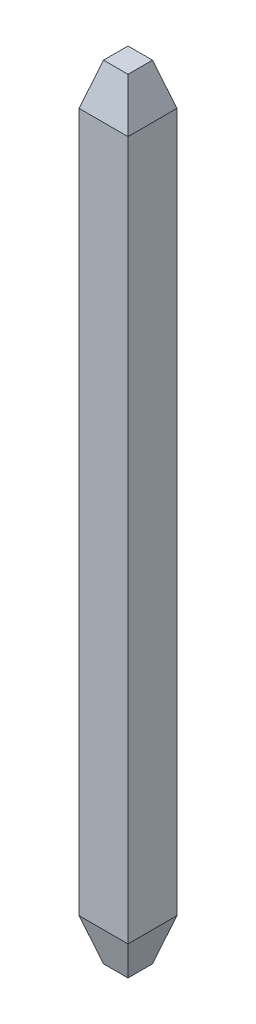
ISO-10303-21;
HEADER;
FILE_DESCRIPTION(('STEP AP214'),'2;1');
FILE_NAME('part.step','',(''),(''),'','','');
FILE_SCHEMA(('AUTOMOTIVE_DESIGN { 1 0 10303 214 1 1 1 1 }'));
ENDSEC;
DATA;
#1=APPLICATION_CONTEXT('core data for automotive mechanical design processes');
#2=APPLICATION_PROTOCOL_DEFINITION('international standard','automotive_design',2000,#1);
#3=PRODUCT_CONTEXT('',#1,'mechanical');
#4=PRODUCT('Part','Part','',(#3));
#5=PRODUCT_RELATED_PRODUCT_CATEGORY('part','',(#4));
#6=PRODUCT_DEFINITION_FORMATION('','',#4);
#7=PRODUCT_DEFINITION_CONTEXT('part definition',#1,'design');
#8=PRODUCT_DEFINITION('design','',#6,#7);
#9=PRODUCT_DEFINITION_SHAPE('','',#8);
#10=(LENGTH_UNIT() NAMED_UNIT(*) SI_UNIT(.MILLI.,.METRE.));
#11=(NAMED_UNIT(*) PLANE_ANGLE_UNIT() SI_UNIT($,.RADIAN.));
#12=(NAMED_UNIT(*) SI_UNIT($,.STERADIAN.) SOLID_ANGLE_UNIT());
#13=UNCERTAINTY_MEASURE_WITH_UNIT(LENGTH_MEASURE(1.E-05),#10,'distance_accuracy_value','');
#14=(GEOMETRIC_REPRESENTATION_CONTEXT(3) GLOBAL_UNCERTAINTY_ASSIGNED_CONTEXT((#13)) GLOBAL_UNIT_ASSIGNED_CONTEXT((#10,
#11,#12)) REPRESENTATION_CONTEXT('',''));
#15=CARTESIAN_POINT('',(0.,0.,0.));
#16=DIRECTION('',(0.,0.,1.));
#17=DIRECTION('',(1.,0.,0.));
#18=AXIS2_PLACEMENT_3D('',#15,#16,#17);
#19=CARTESIAN_POINT('',(-24.289999999987,-5.53543505344796,-19.1989999999763));
#20=DIRECTION('',(-1.,0.,0.));
#21=DIRECTION('',(0.,0.,1.));
#22=AXIS2_PLACEMENT_3D('',#19,#20,#21);
#23=PLANE('',#22);
#24=DIRECTION('',(0.,1.,0.));
#25=VECTOR('',#24,1.);
#26=CARTESIAN_POINT('',(-24.289999999987,-10.1039999999832,-19.8399999999763));
#27=LINE('',#26,#25);
#28=CARTESIAN_POINT('',(-24.289999999987,-10.1039999999832,-19.8399999999763));
#29=VERTEX_POINT('',#28);
#30=CARTESIAN_POINT('',(-24.289999999987,-0.965870106912723,-19.8399999999763));
#31=VERTEX_POINT('',#30);
#32=EDGE_CURVE('E20',#29,#31,#27,.T.);
#33=ORIENTED_EDGE('',*,*,#32,.F.);
#34=DIRECTION('',(0.,0.,-1.));
#35=VECTOR('',#34,1.);
#36=CARTESIAN_POINT('',(-24.289999999987,-10.1039999999832,-19.1999999999763));
#37=LINE('',#36,#35);
#38=CARTESIAN_POINT('',(-24.289999999987,-10.1039999999832,-19.1999999999763));
#39=VERTEX_POINT('',#38);
#40=EDGE_CURVE('E41',#39,#29,#37,.T.);
#41=ORIENTED_EDGE('',*,*,#40,.F.);
#42=DIRECTION('',(0.,1.,0.));
#43=VECTOR('',#42,1.);
#44=CARTESIAN_POINT('',(-24.289999999987,-10.1039999999832,-19.1999999999763));
#45=LINE('',#44,#43);
#46=CARTESIAN_POINT('',(-24.289999999987,-0.965870106912723,-19.1999999999763));
#47=VERTEX_POINT('',#46);
#48=EDGE_CURVE('E11',#39,#47,#45,.T.);
#49=ORIENTED_EDGE('',*,*,#48,.T.);
#50=DIRECTION('',(0.,0.,-1.));
#51=VECTOR('',#50,1.);
#52=CARTESIAN_POINT('',(-24.289999999987,-0.965870106912721,-19.1999999999763));
#53=LINE('',#52,#51);
#54=EDGE_CURVE('E27',#47,#31,#53,.T.);
#55=ORIENTED_EDGE('',*,*,#54,.T.);
#56=EDGE_LOOP('',(#33,#41,#49,#55));
#57=FACE_BOUND('',#56,.T.);
#58=ADVANCED_FACE('F17',(#57),#23,.T.);
#59=CARTESIAN_POINT('',(-23.648999999987,-5.53443505344796,-19.8399999999763));
#60=DIRECTION('',(0.,0.,-1.));
#61=DIRECTION('',(0.,-1.,0.));
#62=AXIS2_PLACEMENT_3D('',#59,#60,#61);
#63=PLANE('',#62);
#64=DIRECTION('',(0.,1.,0.));
#65=VECTOR('',#64,1.);
#66=CARTESIAN_POINT('',(-23.649999999987,-10.1039999999832,-19.8399999999763));
#67=LINE('',#66,#65);
#68=CARTESIAN_POINT('',(-23.649999999987,-10.1039999999832,-19.8399999999763));
#69=VERTEX_POINT('',#68);
#70=CARTESIAN_POINT('',(-23.649999999987,-0.965870106912723,-19.8399999999763));
#71=VERTEX_POINT('',#70);
#72=EDGE_CURVE('E149',#69,#71,#67,.T.);
#73=ORIENTED_EDGE('',*,*,#72,.F.);
#74=DIRECTION('',(1.,0.,0.));
#75=VECTOR('',#74,1.);
#76=CARTESIAN_POINT('',(-24.289999999987,-10.1039999999832,-19.8399999999763));
#77=LINE('',#76,#75);
#78=EDGE_CURVE('E211',#29,#69,#77,.T.);
#79=ORIENTED_EDGE('',*,*,#78,.F.);
#80=ORIENTED_EDGE('',*,*,#32,.T.);
#81=DIRECTION('',(1.,0.,0.));
#82=VECTOR('',#81,1.);
#83=CARTESIAN_POINT('',(-24.289999999987,-0.965870106912721,-19.8399999999763));
#84=LINE('',#83,#82);
#85=EDGE_CURVE('E153',#31,#71,#84,.T.);
#86=ORIENTED_EDGE('',*,*,#85,.T.);
#87=EDGE_LOOP('',(#73,#79,#80,#86));
#88=FACE_BOUND('',#87,.T.);
#89=ADVANCED_FACE('F209',(#88),#63,.T.);
#90=CARTESIAN_POINT('',(-23.649999999987,-11.0738701069127,-19.5199999999763));
#91=DIRECTION('',(1.,0.,0.));
#92=DIRECTION('',(0.,1.,0.));
#93=AXIS2_PLACEMENT_3D('',#90,#91,#92);
#94=PLANE('',#93);
#95=DIRECTION('',(0.,1.,0.));
#96=VECTOR('',#95,1.);
#97=CARTESIAN_POINT('',(-23.649999999987,-10.1039999999832,-19.1999999999763));
#98=LINE('',#97,#96);
#99=CARTESIAN_POINT('',(-23.649999999987,-10.1039999999832,-19.1999999999763));
#100=VERTEX_POINT('',#99);
#101=CARTESIAN_POINT('',(-23.649999999987,-0.965870106912723,-19.1999999999763));
#102=VERTEX_POINT('',#101);
#103=EDGE_CURVE('E95',#100,#102,#98,.T.);
#104=ORIENTED_EDGE('',*,*,#103,.F.);
#105=DIRECTION('',(0.,0.,1.));
#106=VECTOR('',#105,1.);
#107=CARTESIAN_POINT('',(-23.649999999987,-10.1039999999832,-19.8399999999763));
#108=LINE('',#107,#106);
#109=EDGE_CURVE('E131',#69,#100,#108,.T.);
#110=ORIENTED_EDGE('',*,*,#109,.F.);
#111=ORIENTED_EDGE('',*,*,#72,.T.);
#112=DIRECTION('',(0.,0.,1.));
#113=VECTOR('',#112,1.);
#114=CARTESIAN_POINT('',(-23.649999999987,-0.965870106912721,-19.8399999999763));
#115=LINE('',#114,#113);
#116=EDGE_CURVE('E147',#71,#102,#115,.T.);
#117=ORIENTED_EDGE('',*,*,#116,.T.);
#118=EDGE_LOOP('',(#104,#110,#111,#117));
#119=FACE_BOUND('',#118,.T.);
#120=ADVANCED_FACE('F237',(#119),#94,.T.);
#121=CARTESIAN_POINT('',(-23.649999999987,-0.965870106912721,-19.5199999999763));
#122=DIRECTION('',(0.959644900900968,0.281214622974643,0.));
#123=DIRECTION('',(0.,0.,-1.));
#124=AXIS2_PLACEMENT_3D('',#121,#122,#123);
#125=PLANE('',#124);
#126=DIRECTION('',(-0.270714017147727,0.923811583516617,0.270714017147727));
#127=VECTOR('',#126,1.);
#128=CARTESIAN_POINT('',(-23.649999999987,-0.965870106912721,-19.8399999999763));
#129=LINE('',#128,#127);
#130=CARTESIAN_POINT('',(-23.809999999987,-0.419870106912724,-19.6799999999763));
#131=VERTEX_POINT('',#130);
#132=EDGE_CURVE('E185',#71,#131,#129,.T.);
#133=ORIENTED_EDGE('',*,*,#132,.T.);
#134=DIRECTION('',(0.,0.,1.));
#135=VECTOR('',#134,1.);
#136=CARTESIAN_POINT('',(-23.809999999987,-0.419870106912722,-19.6799999999763));
#137=LINE('',#136,#135);
#138=CARTESIAN_POINT('',(-23.809999999987,-0.419870106912724,-19.3599999999763));
#139=VERTEX_POINT('',#138);
#140=EDGE_CURVE('E105',#131,#139,#137,.T.);
#141=ORIENTED_EDGE('',*,*,#140,.T.);
#142=DIRECTION('',(-0.270714017147727,0.923811583516617,-0.270714017147727));
#143=VECTOR('',#142,1.);
#144=CARTESIAN_POINT('',(-23.649999999987,-0.965870106912721,-19.1999999999763));
#145=LINE('',#144,#143);
#146=EDGE_CURVE('E113',#102,#139,#145,.T.);
#147=ORIENTED_EDGE('',*,*,#146,.F.);
#148=ORIENTED_EDGE('',*,*,#116,.F.);
#149=EDGE_LOOP('',(#133,#141,#147,#148));
#150=FACE_BOUND('',#149,.T.);
#151=ADVANCED_FACE('F233',(#150),#125,.T.);
#152=CARTESIAN_POINT('',(-23.969999999987,-0.965870106912721,-19.1999999999763));
#153=DIRECTION('',(0.,0.281214622974643,0.959644900900968));
#154=DIRECTION('',(1.,0.,0.));
#155=AXIS2_PLACEMENT_3D('',#152,#153,#154);
#156=PLANE('',#155);
#157=ORIENTED_EDGE('',*,*,#146,.T.);
#158=DIRECTION('',(-1.,0.,0.));
#159=VECTOR('',#158,1.);
#160=CARTESIAN_POINT('',(-23.809999999987,-0.419870106912722,-19.3599999999763));
#161=LINE('',#160,#159);
#162=CARTESIAN_POINT('',(-24.129999999987,-0.419870106912724,-19.3599999999763));
#163=VERTEX_POINT('',#162);
#164=EDGE_CURVE('E128',#139,#163,#161,.T.);
#165=ORIENTED_EDGE('',*,*,#164,.T.);
#166=DIRECTION('',(0.270714017147727,0.923811583516617,-0.270714017147727));
#167=VECTOR('',#166,1.);
#168=CARTESIAN_POINT('',(-24.289999999987,-0.965870106912721,-19.1999999999763));
#169=LINE('',#168,#167);
#170=EDGE_CURVE('E119',#47,#163,#169,.T.);
#171=ORIENTED_EDGE('',*,*,#170,.F.);
#172=DIRECTION('',(-1.,0.,0.));
#173=VECTOR('',#172,1.);
#174=CARTESIAN_POINT('',(-23.649999999987,-0.965870106912721,-19.1999999999763));
#175=LINE('',#174,#173);
#176=EDGE_CURVE('E143',#102,#47,#175,.T.);
#177=ORIENTED_EDGE('',*,*,#176,.F.);
#178=EDGE_LOOP('',(#157,#165,#171,#177));
#179=FACE_BOUND('',#178,.T.);
#180=ADVANCED_FACE('F129',(#179),#156,.T.);
#181=CARTESIAN_POINT('',(-23.969999999987,-0.419870106912722,-19.6809999999763));
#182=DIRECTION('',(0.,1.,0.));
#183=DIRECTION('',(1.,0.,0.));
#184=AXIS2_PLACEMENT_3D('',#181,#182,#183);
#185=PLANE('',#184);
#186=DIRECTION('',(1.,0.,0.));
#187=VECTOR('',#186,1.);
#188=CARTESIAN_POINT('',(-24.129999999987,-0.419870106912722,-19.6799999999763));
#189=LINE('',#188,#187);
#190=CARTESIAN_POINT('',(-24.129999999987,-0.419870106912724,-19.6799999999763));
#191=VERTEX_POINT('',#190);
#192=EDGE_CURVE('E135',#191,#131,#189,.T.);
#193=ORIENTED_EDGE('',*,*,#192,.F.);
#194=DIRECTION('',(0.,0.,-1.));
#195=VECTOR('',#194,1.);
#196=CARTESIAN_POINT('',(-24.129999999987,-0.419870106912722,-19.3599999999763));
#197=LINE('',#196,#195);
#198=EDGE_CURVE('E123',#163,#191,#197,.T.);
#199=ORIENTED_EDGE('',*,*,#198,.F.);
#200=ORIENTED_EDGE('',*,*,#164,.F.);
#201=ORIENTED_EDGE('',*,*,#140,.F.);
#202=EDGE_LOOP('',(#193,#199,#200,#201));
#203=FACE_BOUND('',#202,.T.);
#204=ADVANCED_FACE('F133',(#203),#185,.T.);
#205=CARTESIAN_POINT('',(-23.649999999987,-10.1039999999832,-19.5199999999763));
#206=DIRECTION('',(0.959644900900968,-0.281214622974643,0.));
#207=DIRECTION('',(0.,0.,-1.));
#208=AXIS2_PLACEMENT_3D('',#205,#206,#207);
#209=PLANE('',#208);
#210=ORIENTED_EDGE('',*,*,#109,.T.);
#211=DIRECTION('',(-0.270714017147727,-0.923811583516618,-0.270714017147727));
#212=VECTOR('',#211,1.);
#213=CARTESIAN_POINT('',(-23.649999999987,-10.1039999999832,-19.1999999999763));
#214=LINE('',#213,#212);
#215=CARTESIAN_POINT('',(-23.809999999987,-10.6499999999832,-19.3599999999763));
#216=VERTEX_POINT('',#215);
#217=EDGE_CURVE('E170',#100,#216,#214,.T.);
#218=ORIENTED_EDGE('',*,*,#217,.T.);
#219=DIRECTION('',(0.,0.,1.));
#220=VECTOR('',#219,1.);
#221=CARTESIAN_POINT('',(-23.809999999987,-10.6499999999832,-19.6799999999763));
#222=LINE('',#221,#220);
#223=CARTESIAN_POINT('',(-23.809999999987,-10.6499999999832,-19.6799999999763));
#224=VERTEX_POINT('',#223);
#225=EDGE_CURVE('E181',#224,#216,#222,.T.);
#226=ORIENTED_EDGE('',*,*,#225,.F.);
#227=DIRECTION('',(-0.270714017147727,-0.923811583516618,0.270714017147727));
#228=VECTOR('',#227,1.);
#229=CARTESIAN_POINT('',(-23.649999999987,-10.1039999999832,-19.8399999999763));
#230=LINE('',#229,#228);
#231=EDGE_CURVE('E126',#69,#224,#230,.T.);
#232=ORIENTED_EDGE('',*,*,#231,.F.);
#233=EDGE_LOOP('',(#210,#218,#226,#232));
#234=FACE_BOUND('',#233,.T.);
#235=ADVANCED_FACE('F241',(#234),#209,.T.);
#236=CARTESIAN_POINT('',(-24.130999999987,-10.6499999999832,-19.5199999999763));
#237=DIRECTION('',(0.,-1.,0.));
#238=DIRECTION('',(0.,0.,-1.));
#239=AXIS2_PLACEMENT_3D('',#236,#237,#238);
#240=PLANE('',#239);
#241=ORIENTED_EDGE('',*,*,#225,.T.);
#242=DIRECTION('',(-1.,0.,0.));
#243=VECTOR('',#242,1.);
#244=CARTESIAN_POINT('',(-23.809999999987,-10.6499999999832,-19.3599999999763));
#245=LINE('',#244,#243);
#246=CARTESIAN_POINT('',(-24.129999999987,-10.6499999999832,-19.3599999999763));
#247=VERTEX_POINT('',#246);
#248=EDGE_CURVE('E166',#216,#247,#245,.T.);
#249=ORIENTED_EDGE('',*,*,#248,.T.);
#250=DIRECTION('',(0.,0.,-1.));
#251=VECTOR('',#250,1.);
#252=CARTESIAN_POINT('',(-24.129999999987,-10.6499999999832,-19.3599999999763));
#253=LINE('',#252,#251);
#254=CARTESIAN_POINT('',(-24.129999999987,-10.6499999999832,-19.6799999999763));
#255=VERTEX_POINT('',#254);
#256=EDGE_CURVE('E161',#247,#255,#253,.T.);
#257=ORIENTED_EDGE('',*,*,#256,.T.);
#258=DIRECTION('',(1.,0.,0.));
#259=VECTOR('',#258,1.);
#260=CARTESIAN_POINT('',(-24.129999999987,-10.6499999999832,-19.6799999999763));
#261=LINE('',#260,#259);
#262=EDGE_CURVE('E157',#255,#224,#261,.T.);
#263=ORIENTED_EDGE('',*,*,#262,.T.);
#264=EDGE_LOOP('',(#241,#249,#257,#263));
#265=FACE_BOUND('',#264,.T.);
#266=ADVANCED_FACE('F245',(#265),#240,.T.);
#267=CARTESIAN_POINT('',(-23.969999999987,-10.1039999999832,-19.1999999999763));
#268=DIRECTION('',(0.,-0.281214622974643,0.959644900900968));
#269=DIRECTION('',(-1.,0.,0.));
#270=AXIS2_PLACEMENT_3D('',#267,#268,#269);
#271=PLANE('',#270);
#272=DIRECTION('',(-1.,0.,0.));
#273=VECTOR('',#272,1.);
#274=CARTESIAN_POINT('',(-23.649999999987,-10.1039999999832,-19.1999999999763));
#275=LINE('',#274,#273);
#276=EDGE_CURVE('E162',#100,#39,#275,.T.);
#277=ORIENTED_EDGE('',*,*,#276,.T.);
#278=DIRECTION('',(0.270714017147727,-0.923811583516618,-0.270714017147727));
#279=VECTOR('',#278,1.);
#280=CARTESIAN_POINT('',(-24.289999999987,-10.1039999999832,-19.1999999999763));
#281=LINE('',#280,#279);
#282=EDGE_CURVE('E174',#39,#247,#281,.T.);
#283=ORIENTED_EDGE('',*,*,#282,.T.);
#284=ORIENTED_EDGE('',*,*,#248,.F.);
#285=ORIENTED_EDGE('',*,*,#217,.F.);
#286=EDGE_LOOP('',(#277,#283,#284,#285));
#287=FACE_BOUND('',#286,.T.);
#288=ADVANCED_FACE('F248',(#287),#271,.T.);
#289=CARTESIAN_POINT('',(-23.969999999987,-0.965870106912721,-19.8399999999763));
#290=DIRECTION('',(0.,0.281214622974643,-0.959644900900968));
#291=DIRECTION('',(-1.,0.,0.));
#292=AXIS2_PLACEMENT_3D('',#289,#290,#291);
#293=PLANE('',#292);
#294=DIRECTION('',(0.270714017147727,0.923811583516617,0.270714017147727));
#295=VECTOR('',#294,1.);
#296=CARTESIAN_POINT('',(-24.289999999987,-0.965870106912721,-19.8399999999763));
#297=LINE('',#296,#295);
#298=EDGE_CURVE('E175',#31,#191,#297,.T.);
#299=ORIENTED_EDGE('',*,*,#298,.T.);
#300=ORIENTED_EDGE('',*,*,#192,.T.);
#301=ORIENTED_EDGE('',*,*,#132,.F.);
#302=ORIENTED_EDGE('',*,*,#85,.F.);
#303=EDGE_LOOP('',(#299,#300,#301,#302));
#304=FACE_BOUND('',#303,.T.);
#305=ADVANCED_FACE('F231',(#304),#293,.T.);
#306=CARTESIAN_POINT('',(-23.969999999987,-10.1039999999832,-19.8399999999763));
#307=DIRECTION('',(0.,-0.281214622974643,-0.959644900900968));
#308=DIRECTION('',(0.,-0.959644900900968,0.281214622974643));
#309=AXIS2_PLACEMENT_3D('',#306,#307,#308);
#310=PLANE('',#309);
#311=ORIENTED_EDGE('',*,*,#78,.T.);
#312=ORIENTED_EDGE('',*,*,#231,.T.);
#313=ORIENTED_EDGE('',*,*,#262,.F.);
#314=DIRECTION('',(0.270714017147727,-0.923811583516618,0.270714017147727));
#315=VECTOR('',#314,1.);
#316=CARTESIAN_POINT('',(-24.289999999987,-10.1039999999832,-19.8399999999763));
#317=LINE('',#316,#315);
#318=EDGE_CURVE('E214',#29,#255,#317,.T.);
#319=ORIENTED_EDGE('',*,*,#318,.F.);
#320=EDGE_LOOP('',(#311,#312,#313,#319));
#321=FACE_BOUND('',#320,.T.);
#322=ADVANCED_FACE('F215',(#321),#310,.T.);
#323=CARTESIAN_POINT('',(-24.289999999987,-0.965870106912721,-19.5199999999763));
#324=DIRECTION('',(-0.959644900900968,0.281214622974643,0.));
#325=DIRECTION('',(0.,0.,1.));
#326=AXIS2_PLACEMENT_3D('',#323,#324,#325);
#327=PLANE('',#326);
#328=ORIENTED_EDGE('',*,*,#170,.T.);
#329=ORIENTED_EDGE('',*,*,#198,.T.);
#330=ORIENTED_EDGE('',*,*,#298,.F.);
#331=ORIENTED_EDGE('',*,*,#54,.F.);
#332=EDGE_LOOP('',(#328,#329,#330,#331));
#333=FACE_BOUND('',#332,.T.);
#334=ADVANCED_FACE('F120',(#333),#327,.T.);
#335=CARTESIAN_POINT('',(-24.290999999987,-5.53543505344796,-19.1999999999763));
#336=DIRECTION('',(0.,0.,1.));
#337=DIRECTION('',(1.,0.,0.));
#338=AXIS2_PLACEMENT_3D('',#335,#336,#337);
#339=PLANE('',#338);
#340=ORIENTED_EDGE('',*,*,#48,.F.);
#341=ORIENTED_EDGE('',*,*,#276,.F.);
#342=ORIENTED_EDGE('',*,*,#103,.T.);
#343=ORIENTED_EDGE('',*,*,#176,.T.);
#344=EDGE_LOOP('',(#340,#341,#342,#343));
#345=FACE_BOUND('',#344,.T.);
#346=ADVANCED_FACE('F250',(#345),#339,.T.);
#347=CARTESIAN_POINT('',(-24.289999999987,-10.1039999999832,-19.5199999999763));
#348=DIRECTION('',(-0.959644900900968,-0.281214622974643,0.));
#349=DIRECTION('',(-0.281214622974643,0.959644900900968,0.));
#350=AXIS2_PLACEMENT_3D('',#347,#348,#349);
#351=PLANE('',#350);
#352=ORIENTED_EDGE('',*,*,#40,.T.);
#353=ORIENTED_EDGE('',*,*,#318,.T.);
#354=ORIENTED_EDGE('',*,*,#256,.F.);
#355=ORIENTED_EDGE('',*,*,#282,.F.);
#356=EDGE_LOOP('',(#352,#353,#354,#355));
#357=FACE_BOUND('',#356,.T.);
#358=ADVANCED_FACE('F246',(#357),#351,.T.);
#359=CLOSED_SHELL('',(#58,#89,#120,#151,#180,#204,#235,#266,#288,#305,#322,#334,#346,#358));
#360=MANIFOLD_SOLID_BREP('B1',#359);
#361=ADVANCED_BREP_SHAPE_REPRESENTATION('',(#18,#360),#14);
#362=SHAPE_DEFINITION_REPRESENTATION(#9,#361);
ENDSEC;
END-ISO-10303-21;
